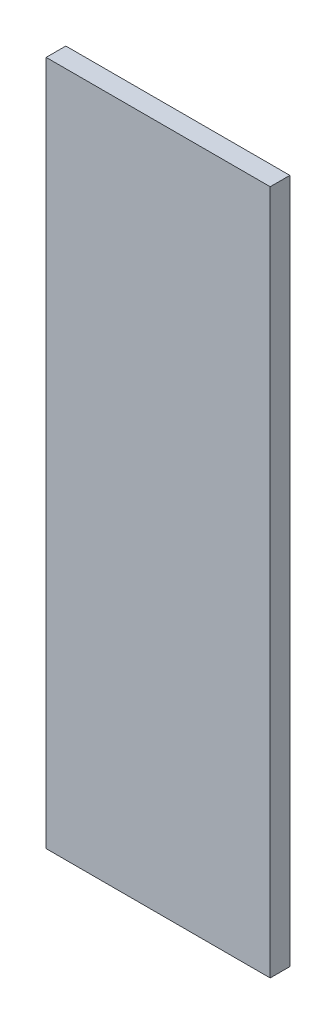
ISO-10303-21;
HEADER;
FILE_DESCRIPTION(('STEP AP214'),'2;1');
FILE_NAME('part.step','',(''),(''),'','','');
FILE_SCHEMA(('AUTOMOTIVE_DESIGN { 1 0 10303 214 1 1 1 1 }'));
ENDSEC;
DATA;
#1=APPLICATION_CONTEXT('core data for automotive mechanical design processes');
#2=APPLICATION_PROTOCOL_DEFINITION('international standard','automotive_design',2000,#1);
#3=PRODUCT_CONTEXT('',#1,'mechanical');
#4=PRODUCT('Part','Part','',(#3));
#5=PRODUCT_RELATED_PRODUCT_CATEGORY('part','',(#4));
#6=PRODUCT_DEFINITION_FORMATION('','',#4);
#7=PRODUCT_DEFINITION_CONTEXT('part definition',#1,'design');
#8=PRODUCT_DEFINITION('design','',#6,#7);
#9=PRODUCT_DEFINITION_SHAPE('','',#8);
#10=(LENGTH_UNIT() NAMED_UNIT(*) SI_UNIT(.MILLI.,.METRE.));
#11=(NAMED_UNIT(*) PLANE_ANGLE_UNIT() SI_UNIT($,.RADIAN.));
#12=(NAMED_UNIT(*) SI_UNIT($,.STERADIAN.) SOLID_ANGLE_UNIT());
#13=UNCERTAINTY_MEASURE_WITH_UNIT(LENGTH_MEASURE(1.E-05),#10,'distance_accuracy_value','');
#14=(GEOMETRIC_REPRESENTATION_CONTEXT(3) GLOBAL_UNCERTAINTY_ASSIGNED_CONTEXT((#13)) GLOBAL_UNIT_ASSIGNED_CONTEXT((#10,
#11,#12)) REPRESENTATION_CONTEXT('',''));
#15=CARTESIAN_POINT('',(0.,0.,0.));
#16=DIRECTION('',(0.,0.,1.));
#17=DIRECTION('',(1.,0.,0.));
#18=AXIS2_PLACEMENT_3D('',#15,#16,#17);
#19=CARTESIAN_POINT('',(-102.5,-313.5,18.));
#20=DIRECTION('',(1.,0.,0.));
#21=DIRECTION('',(0.,0.,-1.));
#22=AXIS2_PLACEMENT_3D('',#19,#20,#21);
#23=PLANE('',#22);
#24=DIRECTION('',(0.,-1.,0.));
#25=VECTOR('',#24,1.);
#26=CARTESIAN_POINT('',(-102.5,-313.5,0.));
#27=LINE('',#26,#25);
#28=CARTESIAN_POINT('',(-102.5,313.5,0.));
#29=VERTEX_POINT('',#28);
#30=CARTESIAN_POINT('',(-102.5,-313.5,0.));
#31=VERTEX_POINT('',#30);
#32=EDGE_CURVE('E95',#29,#31,#27,.T.);
#33=ORIENTED_EDGE('',*,*,#32,.T.);
#34=DIRECTION('',(0.,0.,-1.));
#35=VECTOR('',#34,1.);
#36=CARTESIAN_POINT('',(-102.5,-313.5,18.));
#37=LINE('',#36,#35);
#38=CARTESIAN_POINT('',(-102.5,-313.5,18.));
#39=VERTEX_POINT('',#38);
#40=EDGE_CURVE('E11',#39,#31,#37,.T.);
#41=ORIENTED_EDGE('',*,*,#40,.F.);
#42=DIRECTION('',(0.,-1.,0.));
#43=VECTOR('',#42,1.);
#44=CARTESIAN_POINT('',(-102.5,-313.5,18.));
#45=LINE('',#44,#43);
#46=CARTESIAN_POINT('',(-102.5,313.5,18.));
#47=VERTEX_POINT('',#46);
#48=EDGE_CURVE('E83',#47,#39,#45,.T.);
#49=ORIENTED_EDGE('',*,*,#48,.F.);
#50=DIRECTION('',(0.,0.,-1.));
#51=VECTOR('',#50,1.);
#52=CARTESIAN_POINT('',(-102.5,313.5,18.));
#53=LINE('',#52,#51);
#54=EDGE_CURVE('E91',#47,#29,#53,.T.);
#55=ORIENTED_EDGE('',*,*,#54,.T.);
#56=EDGE_LOOP('',(#33,#41,#49,#55));
#57=FACE_BOUND('',#56,.T.);
#58=ADVANCED_FACE('F32',(#57),#23,.F.);
#59=CARTESIAN_POINT('',(102.5,-313.5,18.));
#60=DIRECTION('',(0.,1.,0.));
#61=DIRECTION('',(0.,0.,1.));
#62=AXIS2_PLACEMENT_3D('',#59,#60,#61);
#63=PLANE('',#62);
#64=DIRECTION('',(1.,0.,0.));
#65=VECTOR('',#64,1.);
#66=CARTESIAN_POINT('',(102.5,-313.5,0.));
#67=LINE('',#66,#65);
#68=CARTESIAN_POINT('',(102.5,-313.5,0.));
#69=VERTEX_POINT('',#68);
#70=EDGE_CURVE('E87',#31,#69,#67,.T.);
#71=ORIENTED_EDGE('',*,*,#70,.T.);
#72=DIRECTION('',(0.,0.,-1.));
#73=VECTOR('',#72,1.);
#74=CARTESIAN_POINT('',(102.5,-313.5,18.));
#75=LINE('',#74,#73);
#76=CARTESIAN_POINT('',(102.5,-313.5,18.));
#77=VERTEX_POINT('',#76);
#78=EDGE_CURVE('E40',#77,#69,#75,.T.);
#79=ORIENTED_EDGE('',*,*,#78,.F.);
#80=DIRECTION('',(1.,0.,0.));
#81=VECTOR('',#80,1.);
#82=CARTESIAN_POINT('',(102.5,-313.5,18.));
#83=LINE('',#82,#81);
#84=EDGE_CURVE('E78',#39,#77,#83,.T.);
#85=ORIENTED_EDGE('',*,*,#84,.F.);
#86=ORIENTED_EDGE('',*,*,#40,.T.);
#87=EDGE_LOOP('',(#71,#79,#85,#86));
#88=FACE_BOUND('',#87,.T.);
#89=ADVANCED_FACE('F86',(#88),#63,.F.);
#90=CARTESIAN_POINT('',(102.5,-313.5,18.));
#91=DIRECTION('',(-1.,0.,0.));
#92=DIRECTION('',(0.,0.,1.));
#93=AXIS2_PLACEMENT_3D('',#90,#91,#92);
#94=PLANE('',#93);
#95=DIRECTION('',(0.,1.,0.));
#96=VECTOR('',#95,1.);
#97=CARTESIAN_POINT('',(102.5,-313.5,0.));
#98=LINE('',#97,#96);
#99=CARTESIAN_POINT('',(102.5,313.5,0.));
#100=VERTEX_POINT('',#99);
#101=EDGE_CURVE('E65',#69,#100,#98,.T.);
#102=ORIENTED_EDGE('',*,*,#101,.T.);
#103=DIRECTION('',(0.,0.,-1.));
#104=VECTOR('',#103,1.);
#105=CARTESIAN_POINT('',(102.5,313.5,18.));
#106=LINE('',#105,#104);
#107=CARTESIAN_POINT('',(102.5,313.5,18.));
#108=VERTEX_POINT('',#107);
#109=EDGE_CURVE('E88',#108,#100,#106,.T.);
#110=ORIENTED_EDGE('',*,*,#109,.F.);
#111=DIRECTION('',(0.,1.,0.));
#112=VECTOR('',#111,1.);
#113=CARTESIAN_POINT('',(102.5,-313.5,18.));
#114=LINE('',#113,#112);
#115=EDGE_CURVE('E81',#77,#108,#114,.T.);
#116=ORIENTED_EDGE('',*,*,#115,.F.);
#117=ORIENTED_EDGE('',*,*,#78,.T.);
#118=EDGE_LOOP('',(#102,#110,#116,#117));
#119=FACE_BOUND('',#118,.T.);
#120=ADVANCED_FACE('F89',(#119),#94,.F.);
#121=CARTESIAN_POINT('',(102.5,313.5,18.));
#122=DIRECTION('',(0.,-1.,0.));
#123=DIRECTION('',(0.,0.,-1.));
#124=AXIS2_PLACEMENT_3D('',#121,#122,#123);
#125=PLANE('',#124);
#126=DIRECTION('',(-1.,0.,0.));
#127=VECTOR('',#126,1.);
#128=CARTESIAN_POINT('',(102.5,313.5,0.));
#129=LINE('',#128,#127);
#130=EDGE_CURVE('E71',#100,#29,#129,.T.);
#131=ORIENTED_EDGE('',*,*,#130,.T.);
#132=ORIENTED_EDGE('',*,*,#54,.F.);
#133=DIRECTION('',(-1.,0.,0.));
#134=VECTOR('',#133,1.);
#135=CARTESIAN_POINT('',(102.5,313.5,18.));
#136=LINE('',#135,#134);
#137=EDGE_CURVE('E48',#108,#47,#136,.T.);
#138=ORIENTED_EDGE('',*,*,#137,.F.);
#139=ORIENTED_EDGE('',*,*,#109,.T.);
#140=EDGE_LOOP('',(#131,#132,#138,#139));
#141=FACE_BOUND('',#140,.T.);
#142=ADVANCED_FACE('F102',(#141),#125,.F.);
#143=CARTESIAN_POINT('',(0.,0.,18.));
#144=DIRECTION('',(0.,0.,1.));
#145=DIRECTION('',(1.,0.,0.));
#146=AXIS2_PLACEMENT_3D('',#143,#144,#145);
#147=PLANE('',#146);
#148=ORIENTED_EDGE('',*,*,#48,.T.);
#149=ORIENTED_EDGE('',*,*,#84,.T.);
#150=ORIENTED_EDGE('',*,*,#115,.T.);
#151=ORIENTED_EDGE('',*,*,#137,.T.);
#152=EDGE_LOOP('',(#148,#149,#150,#151));
#153=FACE_BOUND('',#152,.T.);
#154=ADVANCED_FACE('F79',(#153),#147,.T.);
#155=CARTESIAN_POINT('',(0.,0.,0.));
#156=DIRECTION('',(0.,0.,1.));
#157=DIRECTION('',(1.,0.,0.));
#158=AXIS2_PLACEMENT_3D('',#155,#156,#157);
#159=PLANE('',#158);
#160=ORIENTED_EDGE('',*,*,#32,.F.);
#161=ORIENTED_EDGE('',*,*,#130,.F.);
#162=ORIENTED_EDGE('',*,*,#101,.F.);
#163=ORIENTED_EDGE('',*,*,#70,.F.);
#164=EDGE_LOOP('',(#160,#161,#162,#163));
#165=FACE_BOUND('',#164,.T.);
#166=ADVANCED_FACE('F105',(#165),#159,.F.);
#167=CLOSED_SHELL('',(#58,#89,#120,#142,#154,#166));
#168=MANIFOLD_SOLID_BREP('B2',#167);
#169=ADVANCED_BREP_SHAPE_REPRESENTATION('',(#18,#168),#14);
#170=SHAPE_DEFINITION_REPRESENTATION(#9,#169);
ENDSEC;
END-ISO-10303-21;
